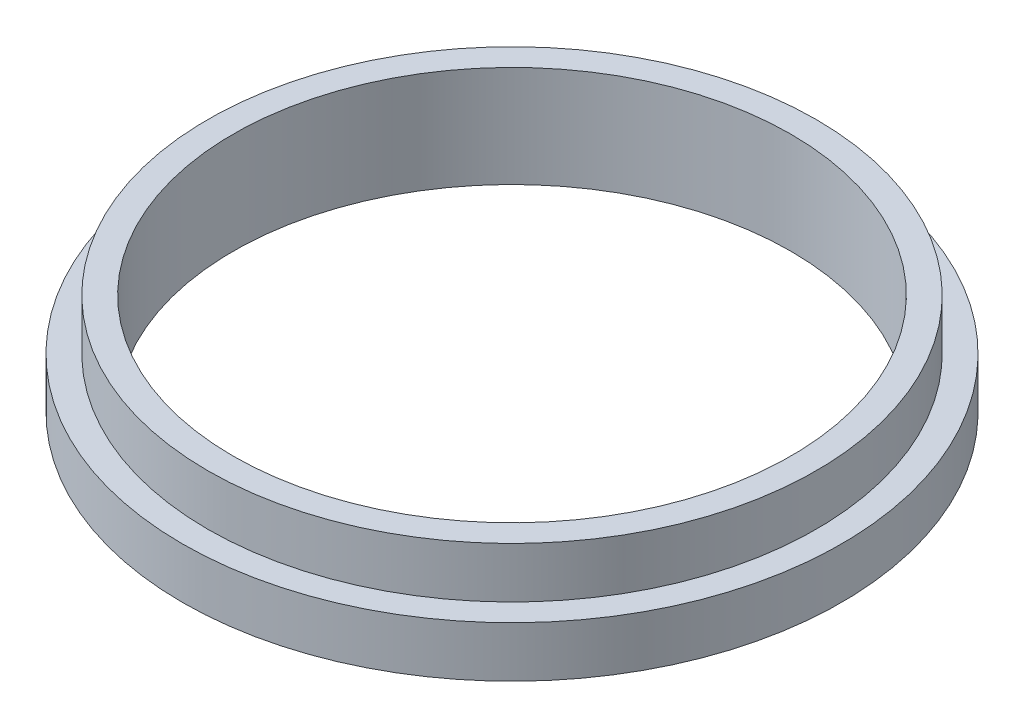
ISO-10303-21;
HEADER;
FILE_DESCRIPTION(('STEP AP214'),'2;1');
FILE_NAME('part.step','',(''),(''),'','','');
FILE_SCHEMA(('AUTOMOTIVE_DESIGN { 1 0 10303 214 1 1 1 1 }'));
ENDSEC;
DATA;
#1=APPLICATION_CONTEXT('core data for automotive mechanical design processes');
#2=APPLICATION_PROTOCOL_DEFINITION('international standard','automotive_design',2000,#1);
#3=PRODUCT_CONTEXT('',#1,'mechanical');
#4=PRODUCT('Part','Part','',(#3));
#5=PRODUCT_RELATED_PRODUCT_CATEGORY('part','',(#4));
#6=PRODUCT_DEFINITION_FORMATION('','',#4);
#7=PRODUCT_DEFINITION_CONTEXT('part definition',#1,'design');
#8=PRODUCT_DEFINITION('design','',#6,#7);
#9=PRODUCT_DEFINITION_SHAPE('','',#8);
#10=(LENGTH_UNIT() NAMED_UNIT(*) SI_UNIT(.MILLI.,.METRE.));
#11=(NAMED_UNIT(*) PLANE_ANGLE_UNIT() SI_UNIT($,.RADIAN.));
#12=(NAMED_UNIT(*) SI_UNIT($,.STERADIAN.) SOLID_ANGLE_UNIT());
#13=UNCERTAINTY_MEASURE_WITH_UNIT(LENGTH_MEASURE(1.E-05),#10,'distance_accuracy_value','');
#14=(GEOMETRIC_REPRESENTATION_CONTEXT(3) GLOBAL_UNCERTAINTY_ASSIGNED_CONTEXT((#13)) GLOBAL_UNIT_ASSIGNED_CONTEXT((#10,
#11,#12)) REPRESENTATION_CONTEXT('',''));
#15=CARTESIAN_POINT('',(0.,0.,0.));
#16=DIRECTION('',(0.,0.,1.));
#17=DIRECTION('',(1.,0.,0.));
#18=AXIS2_PLACEMENT_3D('',#15,#16,#17);
#19=CARTESIAN_POINT('',(0.,10.,0.));
#20=DIRECTION('',(0.,1.,0.));
#21=DIRECTION('',(0.,0.,1.));
#22=AXIS2_PLACEMENT_3D('',#19,#20,#21);
#23=PLANE('',#22);
#24=CARTESIAN_POINT('',(0.,10.,0.));
#25=DIRECTION('',(0.,1.,0.));
#26=DIRECTION('',(0.,0.,1.));
#27=AXIS2_PLACEMENT_3D('',#24,#25,#26);
#28=CIRCLE('',#27,65.);
#29=CARTESIAN_POINT('',(0.,10.,65.));
#30=VERTEX_POINT('',#29);
#31=EDGE_CURVE('E10',#30,#30,#28,.T.);
#32=ORIENTED_EDGE('',*,*,#31,.T.);
#33=EDGE_LOOP('',(#32));
#34=FACE_BOUND('',#33,.T.);
#35=CARTESIAN_POINT('',(0.,10.,0.));
#36=DIRECTION('',(0.,1.,0.));
#37=DIRECTION('',(0.,0.,1.));
#38=AXIS2_PLACEMENT_3D('',#35,#36,#37);
#39=CIRCLE('',#38,60.);
#40=CARTESIAN_POINT('',(0.,10.,60.));
#41=VERTEX_POINT('',#40);
#42=EDGE_CURVE('E60',#41,#41,#39,.T.);
#43=ORIENTED_EDGE('',*,*,#42,.F.);
#44=EDGE_LOOP('',(#43));
#45=FACE_BOUND('',#44,.T.);
#46=ADVANCED_FACE('F41',(#34,#45),#23,.T.);
#47=CARTESIAN_POINT('',(0.,0.,0.));
#48=DIRECTION('',(0.,1.,0.));
#49=DIRECTION('',(0.,0.,1.));
#50=AXIS2_PLACEMENT_3D('',#47,#48,#49);
#51=PLANE('',#50);
#52=CARTESIAN_POINT('',(0.,0.,0.));
#53=DIRECTION('',(0.,1.,0.));
#54=DIRECTION('',(0.,0.,1.));
#55=AXIS2_PLACEMENT_3D('',#52,#53,#54);
#56=CIRCLE('',#55,65.);
#57=CARTESIAN_POINT('',(0.,0.,65.));
#58=VERTEX_POINT('',#57);
#59=EDGE_CURVE('E45',#58,#58,#56,.T.);
#60=ORIENTED_EDGE('',*,*,#59,.F.);
#61=EDGE_LOOP('',(#60));
#62=FACE_BOUND('',#61,.T.);
#63=CARTESIAN_POINT('',(0.,0.,0.));
#64=DIRECTION('',(0.,1.,0.));
#65=DIRECTION('',(0.,0.,1.));
#66=AXIS2_PLACEMENT_3D('',#63,#64,#65);
#67=CIRCLE('',#66,55.);
#68=CARTESIAN_POINT('',(0.,0.,55.));
#69=VERTEX_POINT('',#68);
#70=EDGE_CURVE('E54',#69,#69,#67,.T.);
#71=ORIENTED_EDGE('',*,*,#70,.T.);
#72=EDGE_LOOP('',(#71));
#73=FACE_BOUND('',#72,.T.);
#74=ADVANCED_FACE('F88',(#62,#73),#51,.F.);
#75=CARTESIAN_POINT('',(0.,10.,0.));
#76=DIRECTION('',(0.,-1.,0.));
#77=DIRECTION('',(0.,0.,-1.));
#78=AXIS2_PLACEMENT_3D('',#75,#76,#77);
#79=CYLINDRICAL_SURFACE('',#78,65.);
#80=ORIENTED_EDGE('',*,*,#31,.F.);
#81=EDGE_LOOP('',(#80));
#82=FACE_BOUND('',#81,.T.);
#83=ORIENTED_EDGE('',*,*,#59,.T.);
#84=EDGE_LOOP('',(#83));
#85=FACE_BOUND('',#84,.T.);
#86=ADVANCED_FACE('F43',(#82,#85),#79,.T.);
#87=CARTESIAN_POINT('',(0.,10.,0.));
#88=DIRECTION('',(0.,-1.,0.));
#89=DIRECTION('',(0.,0.,-1.));
#90=AXIS2_PLACEMENT_3D('',#87,#88,#89);
#91=CYLINDRICAL_SURFACE('',#90,55.);
#92=ORIENTED_EDGE('',*,*,#70,.F.);
#93=EDGE_LOOP('',(#92));
#94=FACE_BOUND('',#93,.T.);
#95=CARTESIAN_POINT('',(0.,20.,0.));
#96=DIRECTION('',(0.,1.,0.));
#97=DIRECTION('',(0.,0.,1.));
#98=AXIS2_PLACEMENT_3D('',#95,#96,#97);
#99=CIRCLE('',#98,55.);
#100=CARTESIAN_POINT('',(0.,20.,55.));
#101=VERTEX_POINT('',#100);
#102=EDGE_CURVE('E64',#101,#101,#99,.T.);
#103=ORIENTED_EDGE('',*,*,#102,.T.);
#104=EDGE_LOOP('',(#103));
#105=FACE_BOUND('',#104,.T.);
#106=ADVANCED_FACE('F72',(#94,#105),#91,.F.);
#107=CARTESIAN_POINT('',(0.,20.,0.));
#108=DIRECTION('',(0.,1.,0.));
#109=DIRECTION('',(0.,0.,1.));
#110=AXIS2_PLACEMENT_3D('',#107,#108,#109);
#111=PLANE('',#110);
#112=CARTESIAN_POINT('',(0.,20.,0.));
#113=DIRECTION('',(0.,1.,0.));
#114=DIRECTION('',(0.,0.,1.));
#115=AXIS2_PLACEMENT_3D('',#112,#113,#114);
#116=CIRCLE('',#115,60.);
#117=CARTESIAN_POINT('',(0.,20.,60.));
#118=VERTEX_POINT('',#117);
#119=EDGE_CURVE('E59',#118,#118,#116,.T.);
#120=ORIENTED_EDGE('',*,*,#119,.T.);
#121=EDGE_LOOP('',(#120));
#122=FACE_BOUND('',#121,.T.);
#123=ORIENTED_EDGE('',*,*,#102,.F.);
#124=EDGE_LOOP('',(#123));
#125=FACE_BOUND('',#124,.T.);
#126=ADVANCED_FACE('F74',(#122,#125),#111,.T.);
#127=CARTESIAN_POINT('',(0.,20.,0.));
#128=DIRECTION('',(0.,-1.,0.));
#129=DIRECTION('',(0.,0.,-1.));
#130=AXIS2_PLACEMENT_3D('',#127,#128,#129);
#131=CYLINDRICAL_SURFACE('',#130,60.);
#132=ORIENTED_EDGE('',*,*,#119,.F.);
#133=EDGE_LOOP('',(#132));
#134=FACE_BOUND('',#133,.T.);
#135=ORIENTED_EDGE('',*,*,#42,.T.);
#136=EDGE_LOOP('',(#135));
#137=FACE_BOUND('',#136,.T.);
#138=ADVANCED_FACE('F76',(#134,#137),#131,.T.);
#139=CLOSED_SHELL('',(#46,#74,#86,#106,#126,#138));
#140=MANIFOLD_SOLID_BREP('B2',#139);
#141=ADVANCED_BREP_SHAPE_REPRESENTATION('',(#18,#140),#14);
#142=SHAPE_DEFINITION_REPRESENTATION(#9,#141);
ENDSEC;
END-ISO-10303-21;
